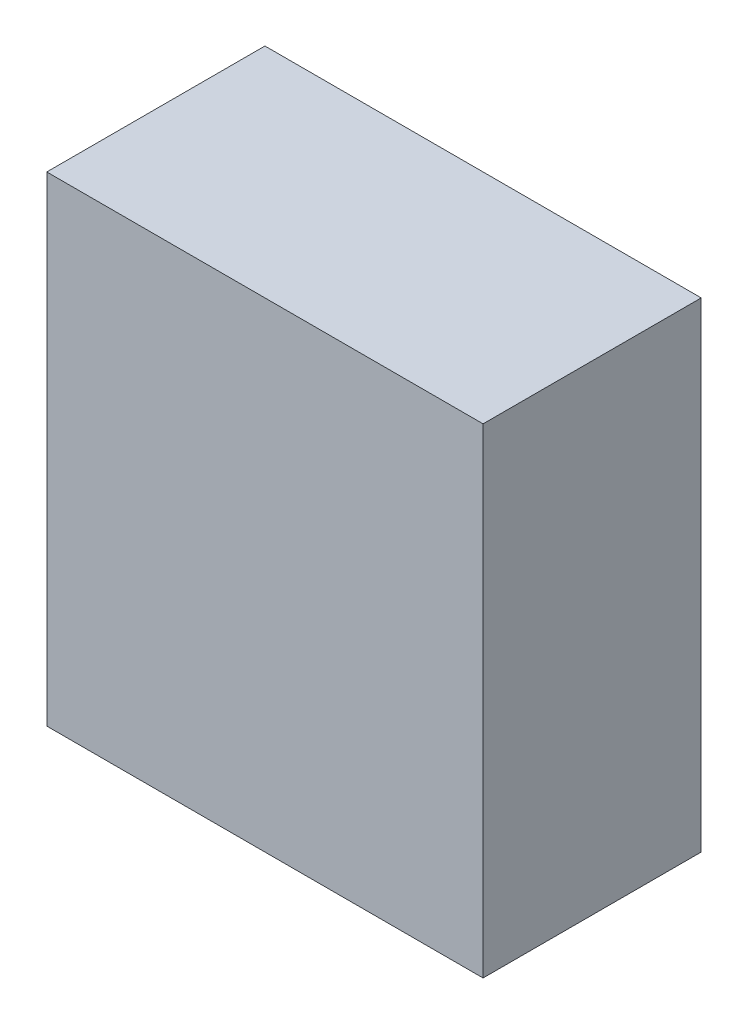
ISO-10303-21;
HEADER;
FILE_DESCRIPTION(('STEP AP214'),'2;1');
FILE_NAME('part.step','',(''),(''),'','','');
FILE_SCHEMA(('AUTOMOTIVE_DESIGN { 1 0 10303 214 1 1 1 1 }'));
ENDSEC;
DATA;
#1=APPLICATION_CONTEXT('core data for automotive mechanical design processes');
#2=APPLICATION_PROTOCOL_DEFINITION('international standard','automotive_design',2000,#1);
#3=PRODUCT_CONTEXT('',#1,'mechanical');
#4=PRODUCT('Part','Part','',(#3));
#5=PRODUCT_RELATED_PRODUCT_CATEGORY('part','',(#4));
#6=PRODUCT_DEFINITION_FORMATION('','',#4);
#7=PRODUCT_DEFINITION_CONTEXT('part definition',#1,'design');
#8=PRODUCT_DEFINITION('design','',#6,#7);
#9=PRODUCT_DEFINITION_SHAPE('','',#8);
#10=(LENGTH_UNIT() NAMED_UNIT(*) SI_UNIT(.MILLI.,.METRE.));
#11=(NAMED_UNIT(*) PLANE_ANGLE_UNIT() SI_UNIT($,.RADIAN.));
#12=(NAMED_UNIT(*) SI_UNIT($,.STERADIAN.) SOLID_ANGLE_UNIT());
#13=UNCERTAINTY_MEASURE_WITH_UNIT(LENGTH_MEASURE(1.E-05),#10,'distance_accuracy_value','');
#14=(GEOMETRIC_REPRESENTATION_CONTEXT(3) GLOBAL_UNCERTAINTY_ASSIGNED_CONTEXT((#13)) GLOBAL_UNIT_ASSIGNED_CONTEXT((#10,
#11,#12)) REPRESENTATION_CONTEXT('',''));
#15=CARTESIAN_POINT('',(0.,0.,0.));
#16=DIRECTION('',(0.,0.,1.));
#17=DIRECTION('',(1.,0.,0.));
#18=AXIS2_PLACEMENT_3D('',#15,#16,#17);
#19=CARTESIAN_POINT('',(-0.499999,0.55000144,0.499999));
#20=DIRECTION('',(0.,0.,-1.));
#21=DIRECTION('',(-1.,0.,0.));
#22=AXIS2_PLACEMENT_3D('',#19,#20,#21);
#23=PLANE('',#22);
#24=DIRECTION('',(1.,0.,0.));
#25=VECTOR('',#24,1.);
#26=CARTESIAN_POINT('',(-0.499999,-0.5499989,0.499999));
#27=LINE('',#26,#25);
#28=CARTESIAN_POINT('',(-0.499999,-0.5499989,0.499999));
#29=VERTEX_POINT('',#28);
#30=CARTESIAN_POINT('',(0.50000154,-0.5499989,0.499999));
#31=VERTEX_POINT('',#30);
#32=EDGE_CURVE('E55',#29,#31,#27,.T.);
#33=ORIENTED_EDGE('',*,*,#32,.T.);
#34=DIRECTION('',(0.,1.,0.));
#35=VECTOR('',#34,1.);
#36=CARTESIAN_POINT('',(0.50000154,-0.5499989,0.499999));
#37=LINE('',#36,#35);
#38=CARTESIAN_POINT('',(0.50000154,0.55000144,0.499999));
#39=VERTEX_POINT('',#38);
#40=EDGE_CURVE('E57',#31,#39,#37,.T.);
#41=ORIENTED_EDGE('',*,*,#40,.T.);
#42=DIRECTION('',(1.,0.,0.));
#43=VECTOR('',#42,1.);
#44=CARTESIAN_POINT('',(0.50000154,0.55000144,0.499999));
#45=LINE('',#44,#43);
#46=CARTESIAN_POINT('',(-0.499999,0.55000144,0.499999));
#47=VERTEX_POINT('',#46);
#48=EDGE_CURVE('E20',#39,#47,#45,.F.);
#49=ORIENTED_EDGE('',*,*,#48,.T.);
#50=DIRECTION('',(0.,1.,0.));
#51=VECTOR('',#50,1.);
#52=CARTESIAN_POINT('',(-0.499999,0.55000144,0.499999));
#53=LINE('',#52,#51);
#54=EDGE_CURVE('E80',#47,#29,#53,.F.);
#55=ORIENTED_EDGE('',*,*,#54,.T.);
#56=EDGE_LOOP('',(#33,#41,#49,#55));
#57=FACE_BOUND('',#56,.T.);
#58=ADVANCED_FACE('F17',(#57),#23,.F.);
#59=CARTESIAN_POINT('',(0.50000154,0.55000144,0.));
#60=DIRECTION('',(0.,-1.,0.));
#61=DIRECTION('',(0.,0.,-1.));
#62=AXIS2_PLACEMENT_3D('',#59,#60,#61);
#63=PLANE('',#62);
#64=DIRECTION('',(0.,0.,-1.));
#65=VECTOR('',#64,1.);
#66=CARTESIAN_POINT('',(-0.499999,0.55000144,0.));
#67=LINE('',#66,#65);
#68=CARTESIAN_POINT('',(-0.499999,0.55000144,0.));
#69=VERTEX_POINT('',#68);
#70=EDGE_CURVE('E68',#69,#47,#67,.F.);
#71=ORIENTED_EDGE('',*,*,#70,.T.);
#72=ORIENTED_EDGE('',*,*,#48,.F.);
#73=DIRECTION('',(0.,0.,1.));
#74=VECTOR('',#73,1.);
#75=CARTESIAN_POINT('',(0.50000154,0.55000144,0.));
#76=LINE('',#75,#74);
#77=CARTESIAN_POINT('',(0.50000154,0.55000144,0.));
#78=VERTEX_POINT('',#77);
#79=EDGE_CURVE('E63',#39,#78,#76,.F.);
#80=ORIENTED_EDGE('',*,*,#79,.T.);
#81=DIRECTION('',(-1.,0.,0.));
#82=VECTOR('',#81,1.);
#83=CARTESIAN_POINT('',(-0.499999,0.55000144,0.));
#84=LINE('',#83,#82);
#85=EDGE_CURVE('E83',#69,#78,#84,.F.);
#86=ORIENTED_EDGE('',*,*,#85,.F.);
#87=EDGE_LOOP('',(#71,#72,#80,#86));
#88=FACE_BOUND('',#87,.T.);
#89=ADVANCED_FACE('F65',(#88),#63,.F.);
#90=CARTESIAN_POINT('',(0.50000154,-0.5499989,0.));
#91=DIRECTION('',(-1.,0.,0.));
#92=DIRECTION('',(0.,0.,1.));
#93=AXIS2_PLACEMENT_3D('',#90,#91,#92);
#94=PLANE('',#93);
#95=ORIENTED_EDGE('',*,*,#79,.F.);
#96=ORIENTED_EDGE('',*,*,#40,.F.);
#97=DIRECTION('',(0.,0.,1.));
#98=VECTOR('',#97,1.);
#99=CARTESIAN_POINT('',(0.50000154,-0.5499989,0.));
#100=LINE('',#99,#98);
#101=CARTESIAN_POINT('',(0.50000154,-0.5499989,0.));
#102=VERTEX_POINT('',#101);
#103=EDGE_CURVE('E75',#31,#102,#100,.F.);
#104=ORIENTED_EDGE('',*,*,#103,.T.);
#105=DIRECTION('',(0.,1.,0.));
#106=VECTOR('',#105,1.);
#107=CARTESIAN_POINT('',(0.50000154,0.55000144,0.));
#108=LINE('',#107,#106);
#109=EDGE_CURVE('E72',#78,#102,#108,.F.);
#110=ORIENTED_EDGE('',*,*,#109,.F.);
#111=EDGE_LOOP('',(#95,#96,#104,#110));
#112=FACE_BOUND('',#111,.T.);
#113=ADVANCED_FACE('F70',(#112),#94,.F.);
#114=CARTESIAN_POINT('',(-0.499999,-0.5499989,0.));
#115=DIRECTION('',(0.,1.,0.));
#116=DIRECTION('',(0.,0.,1.));
#117=AXIS2_PLACEMENT_3D('',#114,#115,#116);
#118=PLANE('',#117);
#119=ORIENTED_EDGE('',*,*,#103,.F.);
#120=ORIENTED_EDGE('',*,*,#32,.F.);
#121=DIRECTION('',(0.,0.,-1.));
#122=VECTOR('',#121,1.);
#123=CARTESIAN_POINT('',(-0.499999,-0.5499989,0.));
#124=LINE('',#123,#122);
#125=CARTESIAN_POINT('',(-0.499999,-0.5499989,0.));
#126=VERTEX_POINT('',#125);
#127=EDGE_CURVE('E35',#29,#126,#124,.T.);
#128=ORIENTED_EDGE('',*,*,#127,.T.);
#129=DIRECTION('',(-1.,0.,0.));
#130=VECTOR('',#129,1.);
#131=CARTESIAN_POINT('',(-0.499999,-0.5499989,0.));
#132=LINE('',#131,#130);
#133=EDGE_CURVE('E26',#102,#126,#132,.T.);
#134=ORIENTED_EDGE('',*,*,#133,.F.);
#135=EDGE_LOOP('',(#119,#120,#128,#134));
#136=FACE_BOUND('',#135,.T.);
#137=ADVANCED_FACE('F89',(#136),#118,.F.);
#138=CARTESIAN_POINT('',(-0.499999,0.55000144,0.));
#139=DIRECTION('',(1.,0.,0.));
#140=DIRECTION('',(0.,0.,-1.));
#141=AXIS2_PLACEMENT_3D('',#138,#139,#140);
#142=PLANE('',#141);
#143=ORIENTED_EDGE('',*,*,#127,.F.);
#144=ORIENTED_EDGE('',*,*,#54,.F.);
#145=ORIENTED_EDGE('',*,*,#70,.F.);
#146=DIRECTION('',(0.,1.,0.));
#147=VECTOR('',#146,1.);
#148=CARTESIAN_POINT('',(-0.499999,0.55000144,0.));
#149=LINE('',#148,#147);
#150=EDGE_CURVE('E11',#126,#69,#149,.T.);
#151=ORIENTED_EDGE('',*,*,#150,.F.);
#152=EDGE_LOOP('',(#143,#144,#145,#151));
#153=FACE_BOUND('',#152,.T.);
#154=ADVANCED_FACE('F91',(#153),#142,.F.);
#155=CARTESIAN_POINT('',(-0.499999,0.55000144,0.));
#156=DIRECTION('',(0.,0.,-1.));
#157=DIRECTION('',(-1.,0.,0.));
#158=AXIS2_PLACEMENT_3D('',#155,#156,#157);
#159=PLANE('',#158);
#160=ORIENTED_EDGE('',*,*,#133,.T.);
#161=ORIENTED_EDGE('',*,*,#150,.T.);
#162=ORIENTED_EDGE('',*,*,#85,.T.);
#163=ORIENTED_EDGE('',*,*,#109,.T.);
#164=EDGE_LOOP('',(#160,#161,#162,#163));
#165=FACE_BOUND('',#164,.T.);
#166=ADVANCED_FACE('F88',(#165),#159,.T.);
#167=CLOSED_SHELL('',(#58,#89,#113,#137,#154,#166));
#168=MANIFOLD_SOLID_BREP('B1',#167);
#169=ADVANCED_BREP_SHAPE_REPRESENTATION('',(#18,#168),#14);
#170=SHAPE_DEFINITION_REPRESENTATION(#9,#169);
ENDSEC;
END-ISO-10303-21;
